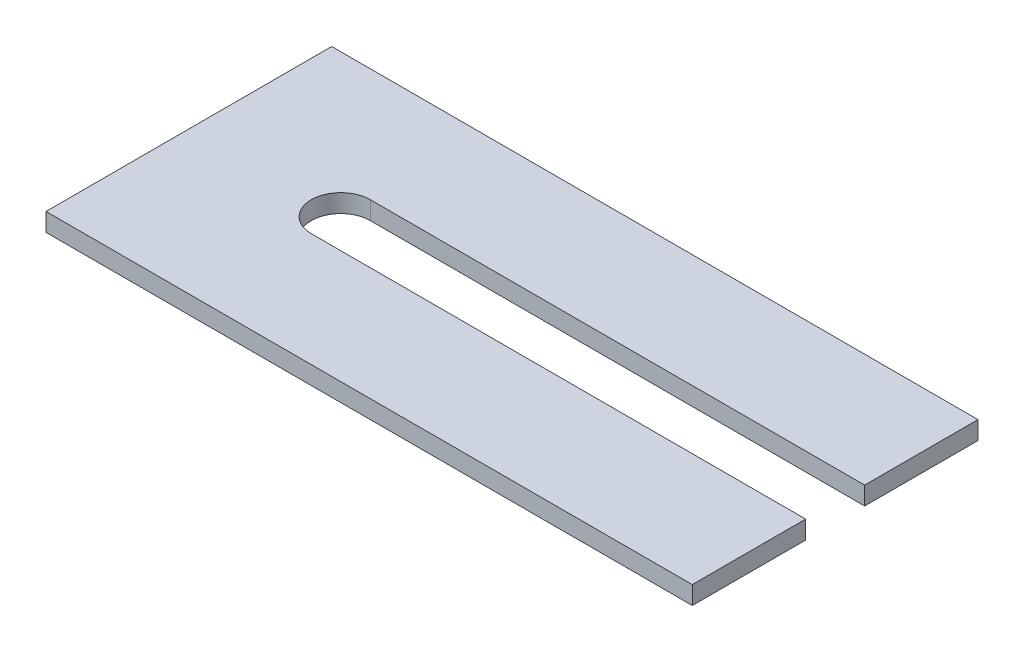
ISO-10303-21;
HEADER;
FILE_DESCRIPTION(('STEP AP214'),'2;1');
FILE_NAME('part.step','',(''),(''),'','','');
FILE_SCHEMA(('AUTOMOTIVE_DESIGN { 1 0 10303 214 1 1 1 1 }'));
ENDSEC;
DATA;
#1=APPLICATION_CONTEXT('core data for automotive mechanical design processes');
#2=APPLICATION_PROTOCOL_DEFINITION('international standard','automotive_design',2000,#1);
#3=PRODUCT_CONTEXT('',#1,'mechanical');
#4=PRODUCT('Part','Part','',(#3));
#5=PRODUCT_RELATED_PRODUCT_CATEGORY('part','',(#4));
#6=PRODUCT_DEFINITION_FORMATION('','',#4);
#7=PRODUCT_DEFINITION_CONTEXT('part definition',#1,'design');
#8=PRODUCT_DEFINITION('design','',#6,#7);
#9=PRODUCT_DEFINITION_SHAPE('','',#8);
#10=(LENGTH_UNIT() NAMED_UNIT(*) SI_UNIT(.MILLI.,.METRE.));
#11=(NAMED_UNIT(*) PLANE_ANGLE_UNIT() SI_UNIT($,.RADIAN.));
#12=(NAMED_UNIT(*) SI_UNIT($,.STERADIAN.) SOLID_ANGLE_UNIT());
#13=UNCERTAINTY_MEASURE_WITH_UNIT(LENGTH_MEASURE(1.E-05),#10,'distance_accuracy_value','');
#14=(GEOMETRIC_REPRESENTATION_CONTEXT(3) GLOBAL_UNCERTAINTY_ASSIGNED_CONTEXT((#13)) GLOBAL_UNIT_ASSIGNED_CONTEXT((#10,
#11,#12)) REPRESENTATION_CONTEXT('',''));
#15=CARTESIAN_POINT('',(0.,0.,0.));
#16=DIRECTION('',(0.,0.,1.));
#17=DIRECTION('',(1.,0.,0.));
#18=AXIS2_PLACEMENT_3D('',#15,#16,#17);
#19=CARTESIAN_POINT('',(16.75,2.,-15.75));
#20=DIRECTION('',(0.,-1.,0.));
#21=DIRECTION('',(0.,0.,-1.));
#22=AXIS2_PLACEMENT_3D('',#19,#20,#21);
#23=CYLINDRICAL_SURFACE('',#22,3.25);
#24=CARTESIAN_POINT('',(16.75,0.,-15.75));
#25=DIRECTION('',(0.,1.,0.));
#26=DIRECTION('',(0.,0.,1.));
#27=AXIS2_PLACEMENT_3D('',#24,#25,#26);
#28=CIRCLE('',#27,3.25);
#29=CARTESIAN_POINT('',(16.75,0.,-19.));
#30=VERTEX_POINT('',#29);
#31=CARTESIAN_POINT('',(16.75,0.,-12.5));
#32=VERTEX_POINT('',#31);
#33=EDGE_CURVE('E191',#30,#32,#28,.T.);
#34=ORIENTED_EDGE('',*,*,#33,.F.);
#35=DIRECTION('',(0.,-1.,0.));
#36=VECTOR('',#35,1.);
#37=CARTESIAN_POINT('',(16.75,2.,-19.));
#38=LINE('',#37,#36);
#39=CARTESIAN_POINT('',(16.75,2.,-19.));
#40=VERTEX_POINT('',#39);
#41=EDGE_CURVE('E11',#40,#30,#38,.T.);
#42=ORIENTED_EDGE('',*,*,#41,.F.);
#43=CARTESIAN_POINT('',(16.75,2.,-15.75));
#44=DIRECTION('',(0.,1.,0.));
#45=DIRECTION('',(0.,0.,1.));
#46=AXIS2_PLACEMENT_3D('',#43,#44,#45);
#47=CIRCLE('',#46,3.25);
#48=CARTESIAN_POINT('',(16.75,2.,-12.5));
#49=VERTEX_POINT('',#48);
#50=EDGE_CURVE('E147',#40,#49,#47,.T.);
#51=ORIENTED_EDGE('',*,*,#50,.T.);
#52=DIRECTION('',(0.,-1.,0.));
#53=VECTOR('',#52,1.);
#54=CARTESIAN_POINT('',(16.75,2.,-12.5));
#55=LINE('',#54,#53);
#56=EDGE_CURVE('E91',#49,#32,#55,.T.);
#57=ORIENTED_EDGE('',*,*,#56,.T.);
#58=EDGE_LOOP('',(#34,#42,#51,#57));
#59=FACE_BOUND('',#58,.T.);
#60=ADVANCED_FACE('F39',(#59),#23,.F.);
#61=CARTESIAN_POINT('',(0.,2.,-19.));
#62=DIRECTION('',(0.,0.,1.));
#63=DIRECTION('',(1.,0.,0.));
#64=AXIS2_PLACEMENT_3D('',#61,#62,#63);
#65=PLANE('',#64);
#66=DIRECTION('',(-1.,0.,0.));
#67=VECTOR('',#66,1.);
#68=CARTESIAN_POINT('',(0.,0.,-19.));
#69=LINE('',#68,#67);
#70=CARTESIAN_POINT('',(71.25,0.,-19.));
#71=VERTEX_POINT('',#70);
#72=EDGE_CURVE('E184',#71,#30,#69,.T.);
#73=ORIENTED_EDGE('',*,*,#72,.F.);
#74=DIRECTION('',(0.,-1.,0.));
#75=VECTOR('',#74,1.);
#76=CARTESIAN_POINT('',(71.25,2.,-19.));
#77=LINE('',#76,#75);
#78=CARTESIAN_POINT('',(71.25,2.,-19.));
#79=VERTEX_POINT('',#78);
#80=EDGE_CURVE('E48',#79,#71,#77,.T.);
#81=ORIENTED_EDGE('',*,*,#80,.F.);
#82=DIRECTION('',(-1.,0.,0.));
#83=VECTOR('',#82,1.);
#84=CARTESIAN_POINT('',(0.,2.,-19.));
#85=LINE('',#84,#83);
#86=EDGE_CURVE('E139',#79,#40,#85,.T.);
#87=ORIENTED_EDGE('',*,*,#86,.T.);
#88=ORIENTED_EDGE('',*,*,#41,.T.);
#89=EDGE_LOOP('',(#73,#81,#87,#88));
#90=FACE_BOUND('',#89,.T.);
#91=ADVANCED_FACE('F189',(#90),#65,.T.);
#92=CARTESIAN_POINT('',(71.25,2.,0.));
#93=DIRECTION('',(-1.,0.,0.));
#94=DIRECTION('',(0.,0.,1.));
#95=AXIS2_PLACEMENT_3D('',#92,#93,#94);
#96=PLANE('',#95);
#97=DIRECTION('',(0.,0.,-1.));
#98=VECTOR('',#97,1.);
#99=CARTESIAN_POINT('',(71.25,0.,0.));
#100=LINE('',#99,#98);
#101=CARTESIAN_POINT('',(71.25,0.,-31.5));
#102=VERTEX_POINT('',#101);
#103=EDGE_CURVE('E159',#71,#102,#100,.T.);
#104=ORIENTED_EDGE('',*,*,#103,.T.);
#105=DIRECTION('',(0.,-1.,0.));
#106=VECTOR('',#105,1.);
#107=CARTESIAN_POINT('',(71.25,2.,-31.5));
#108=LINE('',#107,#106);
#109=CARTESIAN_POINT('',(71.25,2.,-31.5));
#110=VERTEX_POINT('',#109);
#111=EDGE_CURVE('E172',#110,#102,#108,.T.);
#112=ORIENTED_EDGE('',*,*,#111,.F.);
#113=DIRECTION('',(0.,0.,-1.));
#114=VECTOR('',#113,1.);
#115=CARTESIAN_POINT('',(71.25,2.,0.));
#116=LINE('',#115,#114);
#117=EDGE_CURVE('E132',#79,#110,#116,.T.);
#118=ORIENTED_EDGE('',*,*,#117,.F.);
#119=ORIENTED_EDGE('',*,*,#80,.T.);
#120=EDGE_LOOP('',(#104,#112,#118,#119));
#121=FACE_BOUND('',#120,.T.);
#122=ADVANCED_FACE('F178',(#121),#96,.F.);
#123=CARTESIAN_POINT('',(0.,2.,-31.5));
#124=DIRECTION('',(0.,0.,-1.));
#125=DIRECTION('',(-1.,0.,0.));
#126=AXIS2_PLACEMENT_3D('',#123,#124,#125);
#127=PLANE('',#126);
#128=DIRECTION('',(1.,0.,0.));
#129=VECTOR('',#128,1.);
#130=CARTESIAN_POINT('',(0.,0.,-31.5));
#131=LINE('',#130,#129);
#132=CARTESIAN_POINT('',(0.,0.,-31.5));
#133=VERTEX_POINT('',#132);
#134=EDGE_CURVE('E187',#133,#102,#131,.T.);
#135=ORIENTED_EDGE('',*,*,#134,.F.);
#136=DIRECTION('',(0.,-1.,0.));
#137=VECTOR('',#136,1.);
#138=CARTESIAN_POINT('',(0.,2.,-31.5));
#139=LINE('',#138,#137);
#140=CARTESIAN_POINT('',(0.,2.,-31.5));
#141=VERTEX_POINT('',#140);
#142=EDGE_CURVE('E169',#141,#133,#139,.T.);
#143=ORIENTED_EDGE('',*,*,#142,.F.);
#144=DIRECTION('',(1.,0.,0.));
#145=VECTOR('',#144,1.);
#146=CARTESIAN_POINT('',(0.,2.,-31.5));
#147=LINE('',#146,#145);
#148=EDGE_CURVE('E138',#141,#110,#147,.T.);
#149=ORIENTED_EDGE('',*,*,#148,.T.);
#150=ORIENTED_EDGE('',*,*,#111,.T.);
#151=EDGE_LOOP('',(#135,#143,#149,#150));
#152=FACE_BOUND('',#151,.T.);
#153=ADVANCED_FACE('F204',(#152),#127,.T.);
#154=CARTESIAN_POINT('',(0.,2.,0.));
#155=DIRECTION('',(-1.,0.,0.));
#156=DIRECTION('',(0.,0.,1.));
#157=AXIS2_PLACEMENT_3D('',#154,#155,#156);
#158=PLANE('',#157);
#159=DIRECTION('',(0.,0.,-1.));
#160=VECTOR('',#159,1.);
#161=CARTESIAN_POINT('',(0.,0.,0.));
#162=LINE('',#161,#160);
#163=CARTESIAN_POINT('',(0.,0.,0.));
#164=VERTEX_POINT('',#163);
#165=EDGE_CURVE('E197',#164,#133,#162,.T.);
#166=ORIENTED_EDGE('',*,*,#165,.F.);
#167=DIRECTION('',(0.,-1.,0.));
#168=VECTOR('',#167,1.);
#169=CARTESIAN_POINT('',(0.,2.,0.));
#170=LINE('',#169,#168);
#171=CARTESIAN_POINT('',(0.,2.,0.));
#172=VERTEX_POINT('',#171);
#173=EDGE_CURVE('E126',#172,#164,#170,.T.);
#174=ORIENTED_EDGE('',*,*,#173,.F.);
#175=DIRECTION('',(0.,0.,-1.));
#176=VECTOR('',#175,1.);
#177=CARTESIAN_POINT('',(0.,2.,0.));
#178=LINE('',#177,#176);
#179=EDGE_CURVE('E117',#172,#141,#178,.T.);
#180=ORIENTED_EDGE('',*,*,#179,.T.);
#181=ORIENTED_EDGE('',*,*,#142,.T.);
#182=EDGE_LOOP('',(#166,#174,#180,#181));
#183=FACE_BOUND('',#182,.T.);
#184=ADVANCED_FACE('F202',(#183),#158,.T.);
#185=CARTESIAN_POINT('',(0.,2.,0.));
#186=DIRECTION('',(0.,0.,-1.));
#187=DIRECTION('',(-1.,0.,0.));
#188=AXIS2_PLACEMENT_3D('',#185,#186,#187);
#189=PLANE('',#188);
#190=DIRECTION('',(1.,0.,0.));
#191=VECTOR('',#190,1.);
#192=CARTESIAN_POINT('',(0.,0.,0.));
#193=LINE('',#192,#191);
#194=CARTESIAN_POINT('',(71.25,0.,0.));
#195=VERTEX_POINT('',#194);
#196=EDGE_CURVE('E124',#164,#195,#193,.T.);
#197=ORIENTED_EDGE('',*,*,#196,.T.);
#198=DIRECTION('',(0.,-1.,0.));
#199=VECTOR('',#198,1.);
#200=CARTESIAN_POINT('',(71.25,2.,0.));
#201=LINE('',#200,#199);
#202=CARTESIAN_POINT('',(71.25,2.,0.));
#203=VERTEX_POINT('',#202);
#204=EDGE_CURVE('E121',#203,#195,#201,.T.);
#205=ORIENTED_EDGE('',*,*,#204,.F.);
#206=DIRECTION('',(1.,0.,0.));
#207=VECTOR('',#206,1.);
#208=CARTESIAN_POINT('',(0.,2.,0.));
#209=LINE('',#208,#207);
#210=EDGE_CURVE('E110',#172,#203,#209,.T.);
#211=ORIENTED_EDGE('',*,*,#210,.F.);
#212=ORIENTED_EDGE('',*,*,#173,.T.);
#213=EDGE_LOOP('',(#197,#205,#211,#212));
#214=FACE_BOUND('',#213,.T.);
#215=ADVANCED_FACE('F122',(#214),#189,.F.);
#216=CARTESIAN_POINT('',(71.25,0.,-12.5));
#217=VERTEX_POINT('',#216);
#218=EDGE_CURVE('E84',#195,#217,#100,.T.);
#219=ORIENTED_EDGE('',*,*,#218,.T.);
#220=DIRECTION('',(0.,-1.,0.));
#221=VECTOR('',#220,1.);
#222=CARTESIAN_POINT('',(71.25,2.,-12.5));
#223=LINE('',#222,#221);
#224=CARTESIAN_POINT('',(71.25,2.,-12.5));
#225=VERTEX_POINT('',#224);
#226=EDGE_CURVE('E127',#225,#217,#223,.T.);
#227=ORIENTED_EDGE('',*,*,#226,.F.);
#228=EDGE_CURVE('E114',#203,#225,#116,.T.);
#229=ORIENTED_EDGE('',*,*,#228,.F.);
#230=ORIENTED_EDGE('',*,*,#204,.T.);
#231=EDGE_LOOP('',(#219,#227,#229,#230));
#232=FACE_BOUND('',#231,.T.);
#233=ADVANCED_FACE('F129',(#232),#96,.F.);
#234=CARTESIAN_POINT('',(0.,2.,-12.5));
#235=DIRECTION('',(0.,0.,1.));
#236=DIRECTION('',(1.,0.,0.));
#237=AXIS2_PLACEMENT_3D('',#234,#235,#236);
#238=PLANE('',#237);
#239=DIRECTION('',(-1.,0.,0.));
#240=VECTOR('',#239,1.);
#241=CARTESIAN_POINT('',(0.,0.,-12.5));
#242=LINE('',#241,#240);
#243=EDGE_CURVE('E150',#217,#32,#242,.T.);
#244=ORIENTED_EDGE('',*,*,#243,.T.);
#245=ORIENTED_EDGE('',*,*,#56,.F.);
#246=DIRECTION('',(-1.,0.,0.));
#247=VECTOR('',#246,1.);
#248=CARTESIAN_POINT('',(0.,2.,-12.5));
#249=LINE('',#248,#247);
#250=EDGE_CURVE('E56',#225,#49,#249,.T.);
#251=ORIENTED_EDGE('',*,*,#250,.F.);
#252=ORIENTED_EDGE('',*,*,#226,.T.);
#253=EDGE_LOOP('',(#244,#245,#251,#252));
#254=FACE_BOUND('',#253,.T.);
#255=ADVANCED_FACE('F250',(#254),#238,.F.);
#256=CARTESIAN_POINT('',(0.,2.,0.));
#257=DIRECTION('',(0.,1.,0.));
#258=DIRECTION('',(0.,0.,1.));
#259=AXIS2_PLACEMENT_3D('',#256,#257,#258);
#260=PLANE('',#259);
#261=ORIENTED_EDGE('',*,*,#50,.F.);
#262=ORIENTED_EDGE('',*,*,#86,.F.);
#263=ORIENTED_EDGE('',*,*,#117,.T.);
#264=ORIENTED_EDGE('',*,*,#148,.F.);
#265=ORIENTED_EDGE('',*,*,#179,.F.);
#266=ORIENTED_EDGE('',*,*,#210,.T.);
#267=ORIENTED_EDGE('',*,*,#228,.T.);
#268=ORIENTED_EDGE('',*,*,#250,.T.);
#269=EDGE_LOOP('',(#261,#262,#263,#264,#265,#266,#267,#268));
#270=FACE_BOUND('',#269,.T.);
#271=ADVANCED_FACE('F112',(#270),#260,.T.);
#272=CARTESIAN_POINT('',(0.,0.,0.));
#273=DIRECTION('',(0.,1.,0.));
#274=DIRECTION('',(0.,0.,1.));
#275=AXIS2_PLACEMENT_3D('',#272,#273,#274);
#276=PLANE('',#275);
#277=ORIENTED_EDGE('',*,*,#33,.T.);
#278=ORIENTED_EDGE('',*,*,#243,.F.);
#279=ORIENTED_EDGE('',*,*,#218,.F.);
#280=ORIENTED_EDGE('',*,*,#196,.F.);
#281=ORIENTED_EDGE('',*,*,#165,.T.);
#282=ORIENTED_EDGE('',*,*,#134,.T.);
#283=ORIENTED_EDGE('',*,*,#103,.F.);
#284=ORIENTED_EDGE('',*,*,#72,.T.);
#285=EDGE_LOOP('',(#277,#278,#279,#280,#281,#282,#283,#284));
#286=FACE_BOUND('',#285,.T.);
#287=ADVANCED_FACE('F183',(#286),#276,.F.);
#288=CLOSED_SHELL('',(#60,#91,#122,#153,#184,#215,#233,#255,#271,#287));
#289=MANIFOLD_SOLID_BREP('B2',#288);
#290=ADVANCED_BREP_SHAPE_REPRESENTATION('',(#18,#289),#14);
#291=SHAPE_DEFINITION_REPRESENTATION(#9,#290);
ENDSEC;
END-ISO-10303-21;
